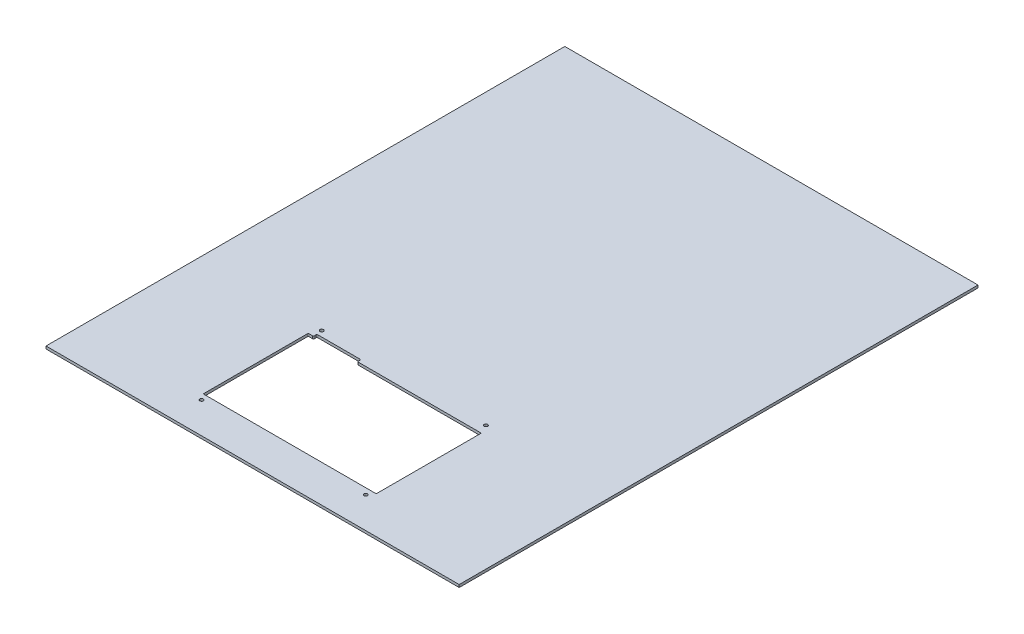
ISO-10303-21;
HEADER;
FILE_DESCRIPTION(('STEP AP214'),'2;1');
FILE_NAME('part.step','',(''),(''),'','','');
FILE_SCHEMA(('AUTOMOTIVE_DESIGN { 1 0 10303 214 1 1 1 1 }'));
ENDSEC;
DATA;
#1=APPLICATION_CONTEXT('core data for automotive mechanical design processes');
#2=APPLICATION_PROTOCOL_DEFINITION('international standard','automotive_design',2000,#1);
#3=PRODUCT_CONTEXT('',#1,'mechanical');
#4=PRODUCT('Part','Part','',(#3));
#5=PRODUCT_RELATED_PRODUCT_CATEGORY('part','',(#4));
#6=PRODUCT_DEFINITION_FORMATION('','',#4);
#7=PRODUCT_DEFINITION_CONTEXT('part definition',#1,'design');
#8=PRODUCT_DEFINITION('design','',#6,#7);
#9=PRODUCT_DEFINITION_SHAPE('','',#8);
#10=(LENGTH_UNIT() NAMED_UNIT(*) SI_UNIT(.MILLI.,.METRE.));
#11=(NAMED_UNIT(*) PLANE_ANGLE_UNIT() SI_UNIT($,.RADIAN.));
#12=(NAMED_UNIT(*) SI_UNIT($,.STERADIAN.) SOLID_ANGLE_UNIT());
#13=UNCERTAINTY_MEASURE_WITH_UNIT(LENGTH_MEASURE(1.E-05),#10,'distance_accuracy_value','');
#14=(GEOMETRIC_REPRESENTATION_CONTEXT(3) GLOBAL_UNCERTAINTY_ASSIGNED_CONTEXT((#13)) GLOBAL_UNIT_ASSIGNED_CONTEXT((#10,
#11,#12)) REPRESENTATION_CONTEXT('',''));
#15=CARTESIAN_POINT('',(0.,0.,0.));
#16=DIRECTION('',(0.,0.,1.));
#17=DIRECTION('',(1.,0.,0.));
#18=AXIS2_PLACEMENT_3D('',#15,#16,#17);
#19=CARTESIAN_POINT('',(197.5,2.5,248.));
#20=DIRECTION('',(-1.,0.,0.));
#21=DIRECTION('',(0.,0.,1.));
#22=AXIS2_PLACEMENT_3D('',#19,#20,#21);
#23=PLANE('',#22);
#24=DIRECTION('',(0.,0.,-1.));
#25=VECTOR('',#24,1.);
#26=CARTESIAN_POINT('',(197.5,0.,248.));
#27=LINE('',#26,#25);
#28=CARTESIAN_POINT('',(197.5,0.,248.));
#29=VERTEX_POINT('',#28);
#30=CARTESIAN_POINT('',(197.5,0.,-248.));
#31=VERTEX_POINT('',#30);
#32=EDGE_CURVE('E284',#29,#31,#27,.T.);
#33=ORIENTED_EDGE('',*,*,#32,.T.);
#34=DIRECTION('',(0.,-1.,0.));
#35=VECTOR('',#34,1.);
#36=CARTESIAN_POINT('',(197.5,2.5,-248.));
#37=LINE('',#36,#35);
#38=CARTESIAN_POINT('',(197.5,2.5,-248.));
#39=VERTEX_POINT('',#38);
#40=EDGE_CURVE('E11',#39,#31,#37,.T.);
#41=ORIENTED_EDGE('',*,*,#40,.F.);
#42=DIRECTION('',(0.,0.,-1.));
#43=VECTOR('',#42,1.);
#44=CARTESIAN_POINT('',(197.5,2.5,248.));
#45=LINE('',#44,#43);
#46=CARTESIAN_POINT('',(197.5,2.5,248.));
#47=VERTEX_POINT('',#46);
#48=EDGE_CURVE('E312',#47,#39,#45,.T.);
#49=ORIENTED_EDGE('',*,*,#48,.F.);
#50=DIRECTION('',(0.,-1.,0.));
#51=VECTOR('',#50,1.);
#52=CARTESIAN_POINT('',(197.5,2.5,248.));
#53=LINE('',#52,#51);
#54=EDGE_CURVE('E322',#47,#29,#53,.T.);
#55=ORIENTED_EDGE('',*,*,#54,.T.);
#56=EDGE_LOOP('',(#33,#41,#49,#55));
#57=FACE_BOUND('',#56,.T.);
#58=ADVANCED_FACE('F39',(#57),#23,.F.);
#59=CARTESIAN_POINT('',(-197.5,2.5,-248.));
#60=DIRECTION('',(0.,0.,1.));
#61=DIRECTION('',(1.,0.,0.));
#62=AXIS2_PLACEMENT_3D('',#59,#60,#61);
#63=PLANE('',#62);
#64=DIRECTION('',(-1.,0.,0.));
#65=VECTOR('',#64,1.);
#66=CARTESIAN_POINT('',(-197.5,0.,-248.));
#67=LINE('',#66,#65);
#68=CARTESIAN_POINT('',(-197.5,0.,-248.));
#69=VERTEX_POINT('',#68);
#70=EDGE_CURVE('E325',#31,#69,#67,.T.);
#71=ORIENTED_EDGE('',*,*,#70,.T.);
#72=DIRECTION('',(0.,-1.,0.));
#73=VECTOR('',#72,1.);
#74=CARTESIAN_POINT('',(-197.5,2.5,-248.));
#75=LINE('',#74,#73);
#76=CARTESIAN_POINT('',(-197.5,2.5,-248.));
#77=VERTEX_POINT('',#76);
#78=EDGE_CURVE('E46',#77,#69,#75,.T.);
#79=ORIENTED_EDGE('',*,*,#78,.F.);
#80=DIRECTION('',(-1.,0.,0.));
#81=VECTOR('',#80,1.);
#82=CARTESIAN_POINT('',(-197.5,2.5,-248.));
#83=LINE('',#82,#81);
#84=EDGE_CURVE('E315',#39,#77,#83,.T.);
#85=ORIENTED_EDGE('',*,*,#84,.F.);
#86=ORIENTED_EDGE('',*,*,#40,.T.);
#87=EDGE_LOOP('',(#71,#79,#85,#86));
#88=FACE_BOUND('',#87,.T.);
#89=ADVANCED_FACE('F353',(#88),#63,.F.);
#90=CARTESIAN_POINT('',(-197.5,2.5,248.));
#91=DIRECTION('',(1.,0.,0.));
#92=DIRECTION('',(0.,0.,-1.));
#93=AXIS2_PLACEMENT_3D('',#90,#91,#92);
#94=PLANE('',#93);
#95=DIRECTION('',(0.,0.,1.));
#96=VECTOR('',#95,1.);
#97=CARTESIAN_POINT('',(-197.5,0.,248.));
#98=LINE('',#97,#96);
#99=CARTESIAN_POINT('',(-197.5,0.,248.));
#100=VERTEX_POINT('',#99);
#101=EDGE_CURVE('E327',#69,#100,#98,.T.);
#102=ORIENTED_EDGE('',*,*,#101,.T.);
#103=DIRECTION('',(0.,-1.,0.));
#104=VECTOR('',#103,1.);
#105=CARTESIAN_POINT('',(-197.5,2.5,248.));
#106=LINE('',#105,#104);
#107=CARTESIAN_POINT('',(-197.5,2.5,248.));
#108=VERTEX_POINT('',#107);
#109=EDGE_CURVE('E332',#108,#100,#106,.T.);
#110=ORIENTED_EDGE('',*,*,#109,.F.);
#111=DIRECTION('',(0.,0.,1.));
#112=VECTOR('',#111,1.);
#113=CARTESIAN_POINT('',(-197.5,2.5,248.));
#114=LINE('',#113,#112);
#115=EDGE_CURVE('E318',#77,#108,#114,.T.);
#116=ORIENTED_EDGE('',*,*,#115,.F.);
#117=ORIENTED_EDGE('',*,*,#78,.T.);
#118=EDGE_LOOP('',(#102,#110,#116,#117));
#119=FACE_BOUND('',#118,.T.);
#120=ADVANCED_FACE('F339',(#119),#94,.F.);
#121=CARTESIAN_POINT('',(-197.5,2.5,248.));
#122=DIRECTION('',(0.,0.,-1.));
#123=DIRECTION('',(-1.,0.,0.));
#124=AXIS2_PLACEMENT_3D('',#121,#122,#123);
#125=PLANE('',#124);
#126=DIRECTION('',(1.,0.,0.));
#127=VECTOR('',#126,1.);
#128=CARTESIAN_POINT('',(-197.5,0.,248.));
#129=LINE('',#128,#127);
#130=EDGE_CURVE('E316',#100,#29,#129,.T.);
#131=ORIENTED_EDGE('',*,*,#130,.T.);
#132=ORIENTED_EDGE('',*,*,#54,.F.);
#133=DIRECTION('',(1.,0.,0.));
#134=VECTOR('',#133,1.);
#135=CARTESIAN_POINT('',(-197.5,2.5,248.));
#136=LINE('',#135,#134);
#137=EDGE_CURVE('E320',#108,#47,#136,.T.);
#138=ORIENTED_EDGE('',*,*,#137,.F.);
#139=ORIENTED_EDGE('',*,*,#109,.T.);
#140=EDGE_LOOP('',(#131,#132,#138,#139));
#141=FACE_BOUND('',#140,.T.);
#142=ADVANCED_FACE('F346',(#141),#125,.F.);
#143=CARTESIAN_POINT('',(0.,2.5,0.));
#144=DIRECTION('',(0.,-1.,0.));
#145=DIRECTION('',(0.,0.,-1.));
#146=AXIS2_PLACEMENT_3D('',#143,#144,#145);
#147=PLANE('',#146);
#148=CARTESIAN_POINT('',(78.5,2.5,218.3));
#149=DIRECTION('',(0.,1.,0.));
#150=DIRECTION('',(0.,0.,1.));
#151=AXIS2_PLACEMENT_3D('',#148,#149,#150);
#152=CIRCLE('',#151,1.64999999999998);
#153=CARTESIAN_POINT('',(78.5,2.5,219.95));
#154=VERTEX_POINT('',#153);
#155=EDGE_CURVE('E465',#154,#154,#152,.T.);
#156=ORIENTED_EDGE('',*,*,#155,.F.);
#157=EDGE_LOOP('',(#156));
#158=FACE_BOUND('',#157,.T.);
#159=CARTESIAN_POINT('',(-78.5,2.5,218.3));
#160=DIRECTION('',(0.,1.,0.));
#161=DIRECTION('',(0.,0.,1.));
#162=AXIS2_PLACEMENT_3D('',#159,#160,#161);
#163=CIRCLE('',#162,1.65000000000002);
#164=CARTESIAN_POINT('',(-78.5,2.5,219.95));
#165=VERTEX_POINT('',#164);
#166=EDGE_CURVE('E457',#165,#165,#163,.T.);
#167=ORIENTED_EDGE('',*,*,#166,.F.);
#168=EDGE_LOOP('',(#167));
#169=FACE_BOUND('',#168,.T.);
#170=CARTESIAN_POINT('',(-78.5,2.5,103.4));
#171=DIRECTION('',(0.,1.,0.));
#172=DIRECTION('',(0.,0.,1.));
#173=AXIS2_PLACEMENT_3D('',#170,#171,#172);
#174=CIRCLE('',#173,1.65);
#175=CARTESIAN_POINT('',(-78.5,2.5,105.05));
#176=VERTEX_POINT('',#175);
#177=EDGE_CURVE('E451',#176,#176,#174,.T.);
#178=ORIENTED_EDGE('',*,*,#177,.F.);
#179=EDGE_LOOP('',(#178));
#180=FACE_BOUND('',#179,.T.);
#181=CARTESIAN_POINT('',(78.5,2.5,103.4));
#182=DIRECTION('',(0.,1.,0.));
#183=DIRECTION('',(0.,0.,1.));
#184=AXIS2_PLACEMENT_3D('',#181,#182,#183);
#185=CIRCLE('',#184,1.65);
#186=CARTESIAN_POINT('',(78.5,2.5,105.05));
#187=VERTEX_POINT('',#186);
#188=EDGE_CURVE('E200',#187,#187,#185,.T.);
#189=ORIENTED_EDGE('',*,*,#188,.F.);
#190=EDGE_LOOP('',(#189));
#191=FACE_BOUND('',#190,.T.);
#192=DIRECTION('',(0.,0.,-1.));
#193=VECTOR('',#192,1.);
#194=CARTESIAN_POINT('',(-35.7,2.5,111.1));
#195=LINE('',#194,#193);
#196=CARTESIAN_POINT('',(-35.7,2.5,111.1));
#197=VERTEX_POINT('',#196);
#198=CARTESIAN_POINT('',(-35.7,2.5,109.8));
#199=VERTEX_POINT('',#198);
#200=EDGE_CURVE('E241',#197,#199,#195,.T.);
#201=ORIENTED_EDGE('',*,*,#200,.F.);
#202=CARTESIAN_POINT('',(-34.7,2.5,111.1));
#203=DIRECTION('',(0.,-1.,0.));
#204=DIRECTION('',(0.,0.,1.));
#205=AXIS2_PLACEMENT_3D('',#202,#203,#204);
#206=CIRCLE('',#205,0.999999999999987);
#207=CARTESIAN_POINT('',(-34.7,2.5,112.1));
#208=VERTEX_POINT('',#207);
#209=EDGE_CURVE('E53',#208,#197,#206,.T.);
#210=ORIENTED_EDGE('',*,*,#209,.F.);
#211=DIRECTION('',(-1.,0.,0.));
#212=VECTOR('',#211,1.);
#213=CARTESIAN_POINT('',(82.2,2.5,112.1));
#214=LINE('',#213,#212);
#215=CARTESIAN_POINT('',(82.2,2.5,112.1));
#216=VERTEX_POINT('',#215);
#217=EDGE_CURVE('E194',#216,#208,#214,.T.);
#218=ORIENTED_EDGE('',*,*,#217,.F.);
#219=CARTESIAN_POINT('',(82.2,2.5,112.6));
#220=DIRECTION('',(0.,1.,0.));
#221=DIRECTION('',(0.,0.,1.));
#222=AXIS2_PLACEMENT_3D('',#219,#220,#221);
#223=CIRCLE('',#222,0.499999999999945);
#224=CARTESIAN_POINT('',(82.7,2.5,112.6));
#225=VERTEX_POINT('',#224);
#226=EDGE_CURVE('E197',#225,#216,#223,.T.);
#227=ORIENTED_EDGE('',*,*,#226,.F.);
#228=DIRECTION('',(0.,0.,-1.));
#229=VECTOR('',#228,1.);
#230=CARTESIAN_POINT('',(82.7,2.5,112.6));
#231=LINE('',#230,#229);
#232=CARTESIAN_POINT('',(82.7,2.5,212.));
#233=VERTEX_POINT('',#232);
#234=EDGE_CURVE('E277',#233,#225,#231,.T.);
#235=ORIENTED_EDGE('',*,*,#234,.F.);
#236=CARTESIAN_POINT('',(82.2,2.5,212.));
#237=DIRECTION('',(0.,1.,0.));
#238=DIRECTION('',(0.,0.,1.));
#239=AXIS2_PLACEMENT_3D('',#236,#237,#238);
#240=CIRCLE('',#239,0.500000000000007);
#241=CARTESIAN_POINT('',(82.2,2.5,212.5));
#242=VERTEX_POINT('',#241);
#243=EDGE_CURVE('E274',#242,#233,#240,.T.);
#244=ORIENTED_EDGE('',*,*,#243,.F.);
#245=DIRECTION('',(1.,0.,0.));
#246=VECTOR('',#245,1.);
#247=CARTESIAN_POINT('',(82.2,2.5,212.5));
#248=LINE('',#247,#246);
#249=CARTESIAN_POINT('',(-82.2,2.5,212.5));
#250=VERTEX_POINT('',#249);
#251=EDGE_CURVE('E271',#250,#242,#248,.T.);
#252=ORIENTED_EDGE('',*,*,#251,.F.);
#253=CARTESIAN_POINT('',(-82.2,2.5,212.));
#254=DIRECTION('',(0.,1.,0.));
#255=DIRECTION('',(0.,0.,1.));
#256=AXIS2_PLACEMENT_3D('',#253,#254,#255);
#257=CIRCLE('',#256,0.500000000000007);
#258=CARTESIAN_POINT('',(-82.7,2.5,212.));
#259=VERTEX_POINT('',#258);
#260=EDGE_CURVE('E268',#259,#250,#257,.T.);
#261=ORIENTED_EDGE('',*,*,#260,.F.);
#262=DIRECTION('',(0.,0.,1.));
#263=VECTOR('',#262,1.);
#264=CARTESIAN_POINT('',(-82.7,2.5,112.6));
#265=LINE('',#264,#263);
#266=CARTESIAN_POINT('',(-82.6999999999999,2.5,112.6));
#267=VERTEX_POINT('',#266);
#268=EDGE_CURVE('E265',#267,#259,#265,.T.);
#269=ORIENTED_EDGE('',*,*,#268,.F.);
#270=CARTESIAN_POINT('',(-82.2,2.5,112.6));
#271=DIRECTION('',(0.,1.,0.));
#272=DIRECTION('',(0.,0.,-1.));
#273=AXIS2_PLACEMENT_3D('',#270,#271,#272);
#274=CIRCLE('',#273,0.499999999999945);
#275=CARTESIAN_POINT('',(-82.2,2.5,112.1));
#276=VERTEX_POINT('',#275);
#277=EDGE_CURVE('E262',#276,#267,#274,.T.);
#278=ORIENTED_EDGE('',*,*,#277,.F.);
#279=DIRECTION('',(-1.,0.,0.));
#280=VECTOR('',#279,1.);
#281=CARTESIAN_POINT('',(-78.7,2.5,112.1));
#282=LINE('',#281,#280);
#283=CARTESIAN_POINT('',(-78.7,2.5,112.1));
#284=VERTEX_POINT('',#283);
#285=EDGE_CURVE('E259',#284,#276,#282,.T.);
#286=ORIENTED_EDGE('',*,*,#285,.F.);
#287=CARTESIAN_POINT('',(-78.7,2.5,111.1));
#288=DIRECTION('',(0.,-1.,0.));
#289=DIRECTION('',(0.,0.,1.));
#290=AXIS2_PLACEMENT_3D('',#287,#288,#289);
#291=CIRCLE('',#290,0.999999999999994);
#292=CARTESIAN_POINT('',(-77.7,2.5,111.1));
#293=VERTEX_POINT('',#292);
#294=EDGE_CURVE('E256',#293,#284,#291,.T.);
#295=ORIENTED_EDGE('',*,*,#294,.F.);
#296=DIRECTION('',(0.,0.,1.));
#297=VECTOR('',#296,1.);
#298=CARTESIAN_POINT('',(-77.7,2.5,111.1));
#299=LINE('',#298,#297);
#300=CARTESIAN_POINT('',(-77.7,2.5,109.8));
#301=VERTEX_POINT('',#300);
#302=EDGE_CURVE('E253',#301,#293,#299,.T.);
#303=ORIENTED_EDGE('',*,*,#302,.F.);
#304=CARTESIAN_POINT('',(-76.7,2.5,109.8));
#305=DIRECTION('',(0.,1.,0.));
#306=DIRECTION('',(0.,0.,1.));
#307=AXIS2_PLACEMENT_3D('',#304,#305,#306);
#308=CIRCLE('',#307,1.);
#309=CARTESIAN_POINT('',(-76.7,2.5,108.8));
#310=VERTEX_POINT('',#309);
#311=EDGE_CURVE('E250',#310,#301,#308,.T.);
#312=ORIENTED_EDGE('',*,*,#311,.F.);
#313=DIRECTION('',(-1.,0.,0.));
#314=VECTOR('',#313,1.);
#315=CARTESIAN_POINT('',(-76.7,2.5,108.8));
#316=LINE('',#315,#314);
#317=CARTESIAN_POINT('',(-36.7,2.5,108.8));
#318=VERTEX_POINT('',#317);
#319=EDGE_CURVE('E247',#318,#310,#316,.T.);
#320=ORIENTED_EDGE('',*,*,#319,.F.);
#321=CARTESIAN_POINT('',(-36.7,2.5,109.8));
#322=DIRECTION('',(0.,1.,0.));
#323=DIRECTION('',(0.,0.,1.));
#324=AXIS2_PLACEMENT_3D('',#321,#322,#323);
#325=CIRCLE('',#324,1.);
#326=EDGE_CURVE('E244',#199,#318,#325,.T.);
#327=ORIENTED_EDGE('',*,*,#326,.F.);
#328=EDGE_LOOP('',(#201,#210,#218,#227,#235,#244,#252,#261,#269,#278,#286,#295,#303,#312,#320,#327));
#329=FACE_BOUND('',#328,.T.);
#330=ORIENTED_EDGE('',*,*,#48,.T.);
#331=ORIENTED_EDGE('',*,*,#84,.T.);
#332=ORIENTED_EDGE('',*,*,#115,.T.);
#333=ORIENTED_EDGE('',*,*,#137,.T.);
#334=EDGE_LOOP('',(#330,#331,#332,#333));
#335=FACE_BOUND('',#334,.T.);
#336=ADVANCED_FACE('F352',(#158,#169,#180,#191,#329,#335),#147,.F.);
#337=CARTESIAN_POINT('',(0.,0.,0.));
#338=DIRECTION('',(0.,-1.,0.));
#339=DIRECTION('',(0.,0.,-1.));
#340=AXIS2_PLACEMENT_3D('',#337,#338,#339);
#341=PLANE('',#340);
#342=CARTESIAN_POINT('',(78.5,0.,218.3));
#343=DIRECTION('',(0.,1.,0.));
#344=DIRECTION('',(0.,0.,1.));
#345=AXIS2_PLACEMENT_3D('',#342,#343,#344);
#346=CIRCLE('',#345,1.64999999999998);
#347=CARTESIAN_POINT('',(78.5,0.,219.95));
#348=VERTEX_POINT('',#347);
#349=EDGE_CURVE('E462',#348,#348,#346,.T.);
#350=ORIENTED_EDGE('',*,*,#349,.T.);
#351=EDGE_LOOP('',(#350));
#352=FACE_BOUND('',#351,.T.);
#353=CARTESIAN_POINT('',(-78.5,0.,218.3));
#354=DIRECTION('',(0.,1.,0.));
#355=DIRECTION('',(0.,0.,1.));
#356=AXIS2_PLACEMENT_3D('',#353,#354,#355);
#357=CIRCLE('',#356,1.65000000000002);
#358=CARTESIAN_POINT('',(-78.5,0.,219.95));
#359=VERTEX_POINT('',#358);
#360=EDGE_CURVE('E453',#359,#359,#357,.T.);
#361=ORIENTED_EDGE('',*,*,#360,.T.);
#362=EDGE_LOOP('',(#361));
#363=FACE_BOUND('',#362,.T.);
#364=CARTESIAN_POINT('',(-78.5,0.,103.4));
#365=DIRECTION('',(0.,1.,0.));
#366=DIRECTION('',(0.,0.,1.));
#367=AXIS2_PLACEMENT_3D('',#364,#365,#366);
#368=CIRCLE('',#367,1.65);
#369=CARTESIAN_POINT('',(-78.5,0.,105.05));
#370=VERTEX_POINT('',#369);
#371=EDGE_CURVE('E448',#370,#370,#368,.T.);
#372=ORIENTED_EDGE('',*,*,#371,.T.);
#373=EDGE_LOOP('',(#372));
#374=FACE_BOUND('',#373,.T.);
#375=CARTESIAN_POINT('',(78.5,0.,103.4));
#376=DIRECTION('',(0.,1.,0.));
#377=DIRECTION('',(0.,0.,1.));
#378=AXIS2_PLACEMENT_3D('',#375,#376,#377);
#379=CIRCLE('',#378,1.65);
#380=CARTESIAN_POINT('',(78.5,0.,105.05));
#381=VERTEX_POINT('',#380);
#382=EDGE_CURVE('E242',#381,#381,#379,.T.);
#383=ORIENTED_EDGE('',*,*,#382,.T.);
#384=EDGE_LOOP('',(#383));
#385=FACE_BOUND('',#384,.T.);
#386=CARTESIAN_POINT('',(-34.7,0.,111.1));
#387=DIRECTION('',(0.,-1.,0.));
#388=DIRECTION('',(0.,0.,1.));
#389=AXIS2_PLACEMENT_3D('',#386,#387,#388);
#390=CIRCLE('',#389,0.999999999999987);
#391=CARTESIAN_POINT('',(-34.7,0.,112.1));
#392=VERTEX_POINT('',#391);
#393=CARTESIAN_POINT('',(-35.7,0.,111.1));
#394=VERTEX_POINT('',#393);
#395=EDGE_CURVE('E177',#392,#394,#390,.T.);
#396=ORIENTED_EDGE('',*,*,#395,.T.);
#397=DIRECTION('',(0.,0.,-1.));
#398=VECTOR('',#397,1.);
#399=CARTESIAN_POINT('',(-35.7,0.,111.1));
#400=LINE('',#399,#398);
#401=CARTESIAN_POINT('',(-35.7,0.,109.8));
#402=VERTEX_POINT('',#401);
#403=EDGE_CURVE('E186',#394,#402,#400,.T.);
#404=ORIENTED_EDGE('',*,*,#403,.T.);
#405=CARTESIAN_POINT('',(-36.7,0.,109.8));
#406=DIRECTION('',(0.,1.,0.));
#407=DIRECTION('',(0.,0.,1.));
#408=AXIS2_PLACEMENT_3D('',#405,#406,#407);
#409=CIRCLE('',#408,1.);
#410=CARTESIAN_POINT('',(-36.7,0.,108.8));
#411=VERTEX_POINT('',#410);
#412=EDGE_CURVE('E61',#402,#411,#409,.T.);
#413=ORIENTED_EDGE('',*,*,#412,.T.);
#414=DIRECTION('',(-1.,0.,0.));
#415=VECTOR('',#414,1.);
#416=CARTESIAN_POINT('',(-76.7,0.,108.8));
#417=LINE('',#416,#415);
#418=CARTESIAN_POINT('',(-76.7,0.,108.8));
#419=VERTEX_POINT('',#418);
#420=EDGE_CURVE('E204',#411,#419,#417,.T.);
#421=ORIENTED_EDGE('',*,*,#420,.T.);
#422=CARTESIAN_POINT('',(-76.7,0.,109.8));
#423=DIRECTION('',(0.,1.,0.));
#424=DIRECTION('',(0.,0.,1.));
#425=AXIS2_PLACEMENT_3D('',#422,#423,#424);
#426=CIRCLE('',#425,1.);
#427=CARTESIAN_POINT('',(-77.7,0.,109.8));
#428=VERTEX_POINT('',#427);
#429=EDGE_CURVE('E207',#419,#428,#426,.T.);
#430=ORIENTED_EDGE('',*,*,#429,.T.);
#431=DIRECTION('',(0.,0.,1.));
#432=VECTOR('',#431,1.);
#433=CARTESIAN_POINT('',(-77.7,0.,111.1));
#434=LINE('',#433,#432);
#435=CARTESIAN_POINT('',(-77.7,0.,111.1));
#436=VERTEX_POINT('',#435);
#437=EDGE_CURVE('E210',#428,#436,#434,.T.);
#438=ORIENTED_EDGE('',*,*,#437,.T.);
#439=CARTESIAN_POINT('',(-78.7,0.,111.1));
#440=DIRECTION('',(0.,-1.,0.));
#441=DIRECTION('',(0.,0.,1.));
#442=AXIS2_PLACEMENT_3D('',#439,#440,#441);
#443=CIRCLE('',#442,0.999999999999994);
#444=CARTESIAN_POINT('',(-78.7,0.,112.1));
#445=VERTEX_POINT('',#444);
#446=EDGE_CURVE('E213',#436,#445,#443,.T.);
#447=ORIENTED_EDGE('',*,*,#446,.T.);
#448=DIRECTION('',(-1.,0.,0.));
#449=VECTOR('',#448,1.);
#450=CARTESIAN_POINT('',(-78.7,0.,112.1));
#451=LINE('',#450,#449);
#452=CARTESIAN_POINT('',(-82.2,0.,112.1));
#453=VERTEX_POINT('',#452);
#454=EDGE_CURVE('E216',#445,#453,#451,.T.);
#455=ORIENTED_EDGE('',*,*,#454,.T.);
#456=CARTESIAN_POINT('',(-82.2,0.,112.6));
#457=DIRECTION('',(0.,1.,0.));
#458=DIRECTION('',(0.,0.,-1.));
#459=AXIS2_PLACEMENT_3D('',#456,#457,#458);
#460=CIRCLE('',#459,0.499999999999945);
#461=CARTESIAN_POINT('',(-82.6999999999999,0.,112.6));
#462=VERTEX_POINT('',#461);
#463=EDGE_CURVE('E219',#453,#462,#460,.T.);
#464=ORIENTED_EDGE('',*,*,#463,.T.);
#465=DIRECTION('',(0.,0.,1.));
#466=VECTOR('',#465,1.);
#467=CARTESIAN_POINT('',(-82.7,0.,112.6));
#468=LINE('',#467,#466);
#469=CARTESIAN_POINT('',(-82.7,0.,212.));
#470=VERTEX_POINT('',#469);
#471=EDGE_CURVE('E222',#462,#470,#468,.T.);
#472=ORIENTED_EDGE('',*,*,#471,.T.);
#473=CARTESIAN_POINT('',(-82.2,0.,212.));
#474=DIRECTION('',(0.,1.,0.));
#475=DIRECTION('',(0.,0.,1.));
#476=AXIS2_PLACEMENT_3D('',#473,#474,#475);
#477=CIRCLE('',#476,0.500000000000007);
#478=CARTESIAN_POINT('',(-82.2,0.,212.5));
#479=VERTEX_POINT('',#478);
#480=EDGE_CURVE('E225',#470,#479,#477,.T.);
#481=ORIENTED_EDGE('',*,*,#480,.T.);
#482=DIRECTION('',(1.,0.,0.));
#483=VECTOR('',#482,1.);
#484=CARTESIAN_POINT('',(82.2,0.,212.5));
#485=LINE('',#484,#483);
#486=CARTESIAN_POINT('',(82.2,0.,212.5));
#487=VERTEX_POINT('',#486);
#488=EDGE_CURVE('E228',#479,#487,#485,.T.);
#489=ORIENTED_EDGE('',*,*,#488,.T.);
#490=CARTESIAN_POINT('',(82.2,0.,212.));
#491=DIRECTION('',(0.,1.,0.));
#492=DIRECTION('',(0.,0.,1.));
#493=AXIS2_PLACEMENT_3D('',#490,#491,#492);
#494=CIRCLE('',#493,0.500000000000007);
#495=CARTESIAN_POINT('',(82.7,0.,212.));
#496=VERTEX_POINT('',#495);
#497=EDGE_CURVE('E231',#487,#496,#494,.T.);
#498=ORIENTED_EDGE('',*,*,#497,.T.);
#499=DIRECTION('',(0.,0.,-1.));
#500=VECTOR('',#499,1.);
#501=CARTESIAN_POINT('',(82.7,0.,112.6));
#502=LINE('',#501,#500);
#503=CARTESIAN_POINT('',(82.7,0.,112.6));
#504=VERTEX_POINT('',#503);
#505=EDGE_CURVE('E234',#496,#504,#502,.T.);
#506=ORIENTED_EDGE('',*,*,#505,.T.);
#507=CARTESIAN_POINT('',(82.2,0.,112.6));
#508=DIRECTION('',(0.,1.,0.));
#509=DIRECTION('',(0.,0.,1.));
#510=AXIS2_PLACEMENT_3D('',#507,#508,#509);
#511=CIRCLE('',#510,0.499999999999945);
#512=CARTESIAN_POINT('',(82.2,0.,112.1));
#513=VERTEX_POINT('',#512);
#514=EDGE_CURVE('E237',#504,#513,#511,.T.);
#515=ORIENTED_EDGE('',*,*,#514,.T.);
#516=DIRECTION('',(-1.,0.,0.));
#517=VECTOR('',#516,1.);
#518=CARTESIAN_POINT('',(82.2,0.,112.1));
#519=LINE('',#518,#517);
#520=EDGE_CURVE('E183',#513,#392,#519,.T.);
#521=ORIENTED_EDGE('',*,*,#520,.T.);
#522=EDGE_LOOP('',(#396,#404,#413,#421,#430,#438,#447,#455,#464,#472,#481,#489,#498,#506,#515,#521));
#523=FACE_BOUND('',#522,.T.);
#524=ORIENTED_EDGE('',*,*,#32,.F.);
#525=ORIENTED_EDGE('',*,*,#130,.F.);
#526=ORIENTED_EDGE('',*,*,#101,.F.);
#527=ORIENTED_EDGE('',*,*,#70,.F.);
#528=EDGE_LOOP('',(#524,#525,#526,#527));
#529=FACE_BOUND('',#528,.T.);
#530=ADVANCED_FACE('F190',(#352,#363,#374,#385,#523,#529),#341,.T.);
#531=CARTESIAN_POINT('',(-34.7,0.,111.1));
#532=DIRECTION('',(0.,1.,0.));
#533=DIRECTION('',(0.,0.,1.));
#534=AXIS2_PLACEMENT_3D('',#531,#532,#533);
#535=CYLINDRICAL_SURFACE('',#534,0.999999999999987);
#536=ORIENTED_EDGE('',*,*,#209,.T.);
#537=DIRECTION('',(0.,1.,0.));
#538=VECTOR('',#537,1.);
#539=CARTESIAN_POINT('',(-35.7,0.,111.1));
#540=LINE('',#539,#538);
#541=EDGE_CURVE('E173',#394,#197,#540,.T.);
#542=ORIENTED_EDGE('',*,*,#541,.F.);
#543=ORIENTED_EDGE('',*,*,#395,.F.);
#544=DIRECTION('',(0.,1.,0.));
#545=VECTOR('',#544,1.);
#546=CARTESIAN_POINT('',(-34.7,0.,112.1));
#547=LINE('',#546,#545);
#548=EDGE_CURVE('E282',#392,#208,#547,.T.);
#549=ORIENTED_EDGE('',*,*,#548,.T.);
#550=EDGE_LOOP('',(#536,#542,#543,#549));
#551=FACE_BOUND('',#550,.T.);
#552=ADVANCED_FACE('F175',(#551),#535,.T.);
#553=CARTESIAN_POINT('',(82.2,0.,112.1));
#554=DIRECTION('',(0.,0.,-1.));
#555=DIRECTION('',(-1.,0.,0.));
#556=AXIS2_PLACEMENT_3D('',#553,#554,#555);
#557=PLANE('',#556);
#558=ORIENTED_EDGE('',*,*,#217,.T.);
#559=ORIENTED_EDGE('',*,*,#548,.F.);
#560=ORIENTED_EDGE('',*,*,#520,.F.);
#561=DIRECTION('',(0.,1.,0.));
#562=VECTOR('',#561,1.);
#563=CARTESIAN_POINT('',(82.2,0.,112.1));
#564=LINE('',#563,#562);
#565=EDGE_CURVE('E285',#513,#216,#564,.T.);
#566=ORIENTED_EDGE('',*,*,#565,.T.);
#567=EDGE_LOOP('',(#558,#559,#560,#566));
#568=FACE_BOUND('',#567,.T.);
#569=ADVANCED_FACE('F371',(#568),#557,.F.);
#570=CARTESIAN_POINT('',(82.2,0.,112.6));
#571=DIRECTION('',(0.,1.,0.));
#572=DIRECTION('',(0.,0.,1.));
#573=AXIS2_PLACEMENT_3D('',#570,#571,#572);
#574=CYLINDRICAL_SURFACE('',#573,0.499999999999945);
#575=ORIENTED_EDGE('',*,*,#226,.T.);
#576=ORIENTED_EDGE('',*,*,#565,.F.);
#577=ORIENTED_EDGE('',*,*,#514,.F.);
#578=DIRECTION('',(0.,1.,0.));
#579=VECTOR('',#578,1.);
#580=CARTESIAN_POINT('',(82.7,0.,112.6));
#581=LINE('',#580,#579);
#582=EDGE_CURVE('E287',#504,#225,#581,.T.);
#583=ORIENTED_EDGE('',*,*,#582,.T.);
#584=EDGE_LOOP('',(#575,#576,#577,#583));
#585=FACE_BOUND('',#584,.T.);
#586=ADVANCED_FACE('F421',(#585),#574,.F.);
#587=CARTESIAN_POINT('',(82.7,0.,112.6));
#588=DIRECTION('',(1.,0.,0.));
#589=DIRECTION('',(0.,0.,-1.));
#590=AXIS2_PLACEMENT_3D('',#587,#588,#589);
#591=PLANE('',#590);
#592=ORIENTED_EDGE('',*,*,#234,.T.);
#593=ORIENTED_EDGE('',*,*,#582,.F.);
#594=ORIENTED_EDGE('',*,*,#505,.F.);
#595=DIRECTION('',(0.,1.,0.));
#596=VECTOR('',#595,1.);
#597=CARTESIAN_POINT('',(82.7,0.,212.));
#598=LINE('',#597,#596);
#599=EDGE_CURVE('E289',#496,#233,#598,.T.);
#600=ORIENTED_EDGE('',*,*,#599,.T.);
#601=EDGE_LOOP('',(#592,#593,#594,#600));
#602=FACE_BOUND('',#601,.T.);
#603=ADVANCED_FACE('F417',(#602),#591,.F.);
#604=CARTESIAN_POINT('',(82.2,0.,212.));
#605=DIRECTION('',(0.,1.,0.));
#606=DIRECTION('',(0.,0.,1.));
#607=AXIS2_PLACEMENT_3D('',#604,#605,#606);
#608=CYLINDRICAL_SURFACE('',#607,0.500000000000007);
#609=ORIENTED_EDGE('',*,*,#243,.T.);
#610=ORIENTED_EDGE('',*,*,#599,.F.);
#611=ORIENTED_EDGE('',*,*,#497,.F.);
#612=DIRECTION('',(0.,1.,0.));
#613=VECTOR('',#612,1.);
#614=CARTESIAN_POINT('',(82.2,0.,212.5));
#615=LINE('',#614,#613);
#616=EDGE_CURVE('E291',#487,#242,#615,.T.);
#617=ORIENTED_EDGE('',*,*,#616,.T.);
#618=EDGE_LOOP('',(#609,#610,#611,#617));
#619=FACE_BOUND('',#618,.T.);
#620=ADVANCED_FACE('F413',(#619),#608,.F.);
#621=CARTESIAN_POINT('',(82.2,0.,212.5));
#622=DIRECTION('',(0.,0.,1.));
#623=DIRECTION('',(1.,0.,0.));
#624=AXIS2_PLACEMENT_3D('',#621,#622,#623);
#625=PLANE('',#624);
#626=ORIENTED_EDGE('',*,*,#251,.T.);
#627=ORIENTED_EDGE('',*,*,#616,.F.);
#628=ORIENTED_EDGE('',*,*,#488,.F.);
#629=DIRECTION('',(0.,1.,0.));
#630=VECTOR('',#629,1.);
#631=CARTESIAN_POINT('',(-82.2,0.,212.5));
#632=LINE('',#631,#630);
#633=EDGE_CURVE('E293',#479,#250,#632,.T.);
#634=ORIENTED_EDGE('',*,*,#633,.T.);
#635=EDGE_LOOP('',(#626,#627,#628,#634));
#636=FACE_BOUND('',#635,.T.);
#637=ADVANCED_FACE('F409',(#636),#625,.F.);
#638=CARTESIAN_POINT('',(-82.2,0.,212.));
#639=DIRECTION('',(0.,1.,0.));
#640=DIRECTION('',(0.,0.,1.));
#641=AXIS2_PLACEMENT_3D('',#638,#639,#640);
#642=CYLINDRICAL_SURFACE('',#641,0.500000000000007);
#643=ORIENTED_EDGE('',*,*,#260,.T.);
#644=ORIENTED_EDGE('',*,*,#633,.F.);
#645=ORIENTED_EDGE('',*,*,#480,.F.);
#646=DIRECTION('',(0.,1.,0.));
#647=VECTOR('',#646,1.);
#648=CARTESIAN_POINT('',(-82.7,0.,212.));
#649=LINE('',#648,#647);
#650=EDGE_CURVE('E295',#470,#259,#649,.T.);
#651=ORIENTED_EDGE('',*,*,#650,.T.);
#652=EDGE_LOOP('',(#643,#644,#645,#651));
#653=FACE_BOUND('',#652,.T.);
#654=ADVANCED_FACE('F405',(#653),#642,.F.);
#655=CARTESIAN_POINT('',(-82.7,0.,112.6));
#656=DIRECTION('',(-1.,0.,0.));
#657=DIRECTION('',(0.,0.,1.));
#658=AXIS2_PLACEMENT_3D('',#655,#656,#657);
#659=PLANE('',#658);
#660=ORIENTED_EDGE('',*,*,#268,.T.);
#661=ORIENTED_EDGE('',*,*,#650,.F.);
#662=ORIENTED_EDGE('',*,*,#471,.F.);
#663=DIRECTION('',(0.,1.,0.));
#664=VECTOR('',#663,1.);
#665=CARTESIAN_POINT('',(-82.6999999999999,0.,112.6));
#666=LINE('',#665,#664);
#667=EDGE_CURVE('E297',#462,#267,#666,.T.);
#668=ORIENTED_EDGE('',*,*,#667,.T.);
#669=EDGE_LOOP('',(#660,#661,#662,#668));
#670=FACE_BOUND('',#669,.T.);
#671=ADVANCED_FACE('F401',(#670),#659,.F.);
#672=CARTESIAN_POINT('',(-82.2,0.,112.6));
#673=DIRECTION('',(0.,1.,0.));
#674=DIRECTION('',(0.,0.,1.));
#675=AXIS2_PLACEMENT_3D('',#672,#673,#674);
#676=CYLINDRICAL_SURFACE('',#675,0.499999999999945);
#677=ORIENTED_EDGE('',*,*,#277,.T.);
#678=ORIENTED_EDGE('',*,*,#667,.F.);
#679=ORIENTED_EDGE('',*,*,#463,.F.);
#680=DIRECTION('',(0.,1.,0.));
#681=VECTOR('',#680,1.);
#682=CARTESIAN_POINT('',(-82.2,0.,112.1));
#683=LINE('',#682,#681);
#684=EDGE_CURVE('E299',#453,#276,#683,.T.);
#685=ORIENTED_EDGE('',*,*,#684,.T.);
#686=EDGE_LOOP('',(#677,#678,#679,#685));
#687=FACE_BOUND('',#686,.T.);
#688=ADVANCED_FACE('F397',(#687),#676,.F.);
#689=CARTESIAN_POINT('',(-78.7,0.,112.1));
#690=DIRECTION('',(0.,0.,-1.));
#691=DIRECTION('',(-1.,0.,0.));
#692=AXIS2_PLACEMENT_3D('',#689,#690,#691);
#693=PLANE('',#692);
#694=ORIENTED_EDGE('',*,*,#285,.T.);
#695=ORIENTED_EDGE('',*,*,#684,.F.);
#696=ORIENTED_EDGE('',*,*,#454,.F.);
#697=DIRECTION('',(0.,1.,0.));
#698=VECTOR('',#697,1.);
#699=CARTESIAN_POINT('',(-78.7,0.,112.1));
#700=LINE('',#699,#698);
#701=EDGE_CURVE('E301',#445,#284,#700,.T.);
#702=ORIENTED_EDGE('',*,*,#701,.T.);
#703=EDGE_LOOP('',(#694,#695,#696,#702));
#704=FACE_BOUND('',#703,.T.);
#705=ADVANCED_FACE('F393',(#704),#693,.F.);
#706=CARTESIAN_POINT('',(-78.7,0.,111.1));
#707=DIRECTION('',(0.,1.,0.));
#708=DIRECTION('',(0.,0.,1.));
#709=AXIS2_PLACEMENT_3D('',#706,#707,#708);
#710=CYLINDRICAL_SURFACE('',#709,0.999999999999994);
#711=ORIENTED_EDGE('',*,*,#294,.T.);
#712=ORIENTED_EDGE('',*,*,#701,.F.);
#713=ORIENTED_EDGE('',*,*,#446,.F.);
#714=DIRECTION('',(0.,1.,0.));
#715=VECTOR('',#714,1.);
#716=CARTESIAN_POINT('',(-77.7,0.,111.1));
#717=LINE('',#716,#715);
#718=EDGE_CURVE('E303',#436,#293,#717,.T.);
#719=ORIENTED_EDGE('',*,*,#718,.T.);
#720=EDGE_LOOP('',(#711,#712,#713,#719));
#721=FACE_BOUND('',#720,.T.);
#722=ADVANCED_FACE('F389',(#721),#710,.T.);
#723=CARTESIAN_POINT('',(-77.7,0.,111.1));
#724=DIRECTION('',(-1.,0.,0.));
#725=DIRECTION('',(0.,0.,1.));
#726=AXIS2_PLACEMENT_3D('',#723,#724,#725);
#727=PLANE('',#726);
#728=ORIENTED_EDGE('',*,*,#302,.T.);
#729=ORIENTED_EDGE('',*,*,#718,.F.);
#730=ORIENTED_EDGE('',*,*,#437,.F.);
#731=DIRECTION('',(0.,1.,0.));
#732=VECTOR('',#731,1.);
#733=CARTESIAN_POINT('',(-77.7,0.,109.8));
#734=LINE('',#733,#732);
#735=EDGE_CURVE('E305',#428,#301,#734,.T.);
#736=ORIENTED_EDGE('',*,*,#735,.T.);
#737=EDGE_LOOP('',(#728,#729,#730,#736));
#738=FACE_BOUND('',#737,.T.);
#739=ADVANCED_FACE('F385',(#738),#727,.F.);
#740=CARTESIAN_POINT('',(-76.7,0.,109.8));
#741=DIRECTION('',(0.,1.,0.));
#742=DIRECTION('',(0.,0.,1.));
#743=AXIS2_PLACEMENT_3D('',#740,#741,#742);
#744=CYLINDRICAL_SURFACE('',#743,1.);
#745=ORIENTED_EDGE('',*,*,#311,.T.);
#746=ORIENTED_EDGE('',*,*,#735,.F.);
#747=ORIENTED_EDGE('',*,*,#429,.F.);
#748=DIRECTION('',(0.,1.,0.));
#749=VECTOR('',#748,1.);
#750=CARTESIAN_POINT('',(-76.7,0.,108.8));
#751=LINE('',#750,#749);
#752=EDGE_CURVE('E307',#419,#310,#751,.T.);
#753=ORIENTED_EDGE('',*,*,#752,.T.);
#754=EDGE_LOOP('',(#745,#746,#747,#753));
#755=FACE_BOUND('',#754,.T.);
#756=ADVANCED_FACE('F381',(#755),#744,.F.);
#757=CARTESIAN_POINT('',(-76.7,0.,108.8));
#758=DIRECTION('',(0.,0.,-1.));
#759=DIRECTION('',(-1.,0.,0.));
#760=AXIS2_PLACEMENT_3D('',#757,#758,#759);
#761=PLANE('',#760);
#762=ORIENTED_EDGE('',*,*,#319,.T.);
#763=ORIENTED_EDGE('',*,*,#752,.F.);
#764=ORIENTED_EDGE('',*,*,#420,.F.);
#765=DIRECTION('',(0.,1.,0.));
#766=VECTOR('',#765,1.);
#767=CARTESIAN_POINT('',(-36.7,0.,108.8));
#768=LINE('',#767,#766);
#769=EDGE_CURVE('E309',#411,#318,#768,.T.);
#770=ORIENTED_EDGE('',*,*,#769,.T.);
#771=EDGE_LOOP('',(#762,#763,#764,#770));
#772=FACE_BOUND('',#771,.T.);
#773=ADVANCED_FACE('F378',(#772),#761,.F.);
#774=CARTESIAN_POINT('',(-36.7,0.,109.8));
#775=DIRECTION('',(0.,1.,0.));
#776=DIRECTION('',(0.,0.,1.));
#777=AXIS2_PLACEMENT_3D('',#774,#775,#776);
#778=CYLINDRICAL_SURFACE('',#777,1.);
#779=ORIENTED_EDGE('',*,*,#326,.T.);
#780=ORIENTED_EDGE('',*,*,#769,.F.);
#781=ORIENTED_EDGE('',*,*,#412,.F.);
#782=DIRECTION('',(0.,1.,0.));
#783=VECTOR('',#782,1.);
#784=CARTESIAN_POINT('',(-35.7,0.,109.8));
#785=LINE('',#784,#783);
#786=EDGE_CURVE('E182',#402,#199,#785,.T.);
#787=ORIENTED_EDGE('',*,*,#786,.T.);
#788=EDGE_LOOP('',(#779,#780,#781,#787));
#789=FACE_BOUND('',#788,.T.);
#790=ADVANCED_FACE('F375',(#789),#778,.F.);
#791=CARTESIAN_POINT('',(-35.7,0.,111.1));
#792=DIRECTION('',(1.,0.,0.));
#793=DIRECTION('',(0.,0.,-1.));
#794=AXIS2_PLACEMENT_3D('',#791,#792,#793);
#795=PLANE('',#794);
#796=ORIENTED_EDGE('',*,*,#200,.T.);
#797=ORIENTED_EDGE('',*,*,#786,.F.);
#798=ORIENTED_EDGE('',*,*,#403,.F.);
#799=ORIENTED_EDGE('',*,*,#541,.T.);
#800=EDGE_LOOP('',(#796,#797,#798,#799));
#801=FACE_BOUND('',#800,.T.);
#802=ADVANCED_FACE('F187',(#801),#795,.F.);
#803=CARTESIAN_POINT('',(78.5,0.,103.4));
#804=DIRECTION('',(0.,1.,0.));
#805=DIRECTION('',(0.,0.,1.));
#806=AXIS2_PLACEMENT_3D('',#803,#804,#805);
#807=CYLINDRICAL_SURFACE('',#806,1.65);
#808=ORIENTED_EDGE('',*,*,#382,.F.);
#809=EDGE_LOOP('',(#808));
#810=FACE_BOUND('',#809,.T.);
#811=ORIENTED_EDGE('',*,*,#188,.T.);
#812=EDGE_LOOP('',(#811));
#813=FACE_BOUND('',#812,.T.);
#814=ADVANCED_FACE('F374',(#810,#813),#807,.F.);
#815=CARTESIAN_POINT('',(-78.5,0.,103.4));
#816=DIRECTION('',(0.,1.,0.));
#817=DIRECTION('',(0.,0.,1.));
#818=AXIS2_PLACEMENT_3D('',#815,#816,#817);
#819=CYLINDRICAL_SURFACE('',#818,1.65);
#820=ORIENTED_EDGE('',*,*,#371,.F.);
#821=EDGE_LOOP('',(#820));
#822=FACE_BOUND('',#821,.T.);
#823=ORIENTED_EDGE('',*,*,#177,.T.);
#824=EDGE_LOOP('',(#823));
#825=FACE_BOUND('',#824,.T.);
#826=ADVANCED_FACE('F431',(#822,#825),#819,.F.);
#827=CARTESIAN_POINT('',(-78.5,0.,218.3));
#828=DIRECTION('',(0.,1.,0.));
#829=DIRECTION('',(0.,0.,1.));
#830=AXIS2_PLACEMENT_3D('',#827,#828,#829);
#831=CYLINDRICAL_SURFACE('',#830,1.65000000000002);
#832=ORIENTED_EDGE('',*,*,#360,.F.);
#833=EDGE_LOOP('',(#832));
#834=FACE_BOUND('',#833,.T.);
#835=ORIENTED_EDGE('',*,*,#166,.T.);
#836=EDGE_LOOP('',(#835));
#837=FACE_BOUND('',#836,.T.);
#838=ADVANCED_FACE('F436',(#834,#837),#831,.F.);
#839=CARTESIAN_POINT('',(78.5,0.,218.3));
#840=DIRECTION('',(0.,1.,0.));
#841=DIRECTION('',(0.,0.,1.));
#842=AXIS2_PLACEMENT_3D('',#839,#840,#841);
#843=CYLINDRICAL_SURFACE('',#842,1.64999999999998);
#844=ORIENTED_EDGE('',*,*,#349,.F.);
#845=EDGE_LOOP('',(#844));
#846=FACE_BOUND('',#845,.T.);
#847=ORIENTED_EDGE('',*,*,#155,.T.);
#848=EDGE_LOOP('',(#847));
#849=FACE_BOUND('',#848,.T.);
#850=ADVANCED_FACE('F433',(#846,#849),#843,.F.);
#851=CLOSED_SHELL('',(#58,#89,#120,#142,#336,#530,#552,#569,#586,#603,#620,#637,#654,#671,#688,
#705,#722,#739,#756,#773,#790,#802,#814,#826,#838,#850));
#852=MANIFOLD_SOLID_BREP('B2',#851);
#853=ADVANCED_BREP_SHAPE_REPRESENTATION('',(#18,#852),#14);
#854=SHAPE_DEFINITION_REPRESENTATION(#9,#853);
ENDSEC;
END-ISO-10303-21;
